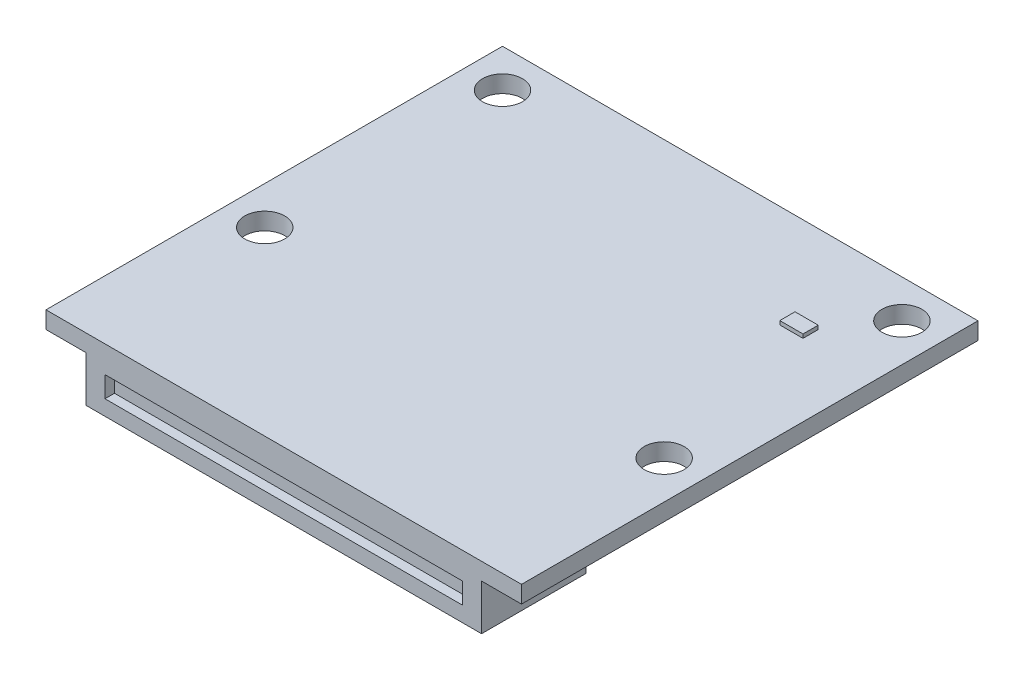
ISO-10303-21;
HEADER;
FILE_DESCRIPTION(('STEP AP214'),'2;1');
FILE_NAME('part.step','',(''),(''),'','','');
FILE_SCHEMA(('AUTOMOTIVE_DESIGN { 1 0 10303 214 1 1 1 1 }'));
ENDSEC;
DATA;
#1=APPLICATION_CONTEXT('core data for automotive mechanical design processes');
#2=APPLICATION_PROTOCOL_DEFINITION('international standard','automotive_design',2000,#1);
#3=PRODUCT_CONTEXT('',#1,'mechanical');
#4=PRODUCT('Part','Part','',(#3));
#5=PRODUCT_RELATED_PRODUCT_CATEGORY('part','',(#4));
#6=PRODUCT_DEFINITION_FORMATION('','',#4);
#7=PRODUCT_DEFINITION_CONTEXT('part definition',#1,'design');
#8=PRODUCT_DEFINITION('design','',#6,#7);
#9=PRODUCT_DEFINITION_SHAPE('','',#8);
#10=(LENGTH_UNIT() NAMED_UNIT(*) SI_UNIT(.MILLI.,.METRE.));
#11=(NAMED_UNIT(*) PLANE_ANGLE_UNIT() SI_UNIT($,.RADIAN.));
#12=(NAMED_UNIT(*) SI_UNIT($,.STERADIAN.) SOLID_ANGLE_UNIT());
#13=UNCERTAINTY_MEASURE_WITH_UNIT(LENGTH_MEASURE(1.E-05),#10,'distance_accuracy_value','');
#14=(GEOMETRIC_REPRESENTATION_CONTEXT(3) GLOBAL_UNCERTAINTY_ASSIGNED_CONTEXT((#13)) GLOBAL_UNIT_ASSIGNED_CONTEXT((#10,
#11,#12)) REPRESENTATION_CONTEXT('',''));
#15=CARTESIAN_POINT('',(0.,0.,0.));
#16=DIRECTION('',(0.,0.,1.));
#17=DIRECTION('',(1.,0.,0.));
#18=AXIS2_PLACEMENT_3D('',#15,#16,#17);
#19=CARTESIAN_POINT('',(0.,0.,0.));
#20=DIRECTION('',(0.,1.,0.));
#21=DIRECTION('',(0.,0.,1.));
#22=AXIS2_PLACEMENT_3D('',#19,#20,#21);
#23=PLANE('',#22);
#24=DIRECTION('',(0.,0.,1.));
#25=VECTOR('',#24,1.);
#26=CARTESIAN_POINT('',(-12.5,0.,-14.5));
#27=LINE('',#26,#25);
#28=CARTESIAN_POINT('',(-12.5,0.,-14.5));
#29=VERTEX_POINT('',#28);
#30=CARTESIAN_POINT('',(-12.5,0.,9.5));
#31=VERTEX_POINT('',#30);
#32=EDGE_CURVE('E277',#29,#31,#27,.T.);
#33=ORIENTED_EDGE('',*,*,#32,.T.);
#34=DIRECTION('',(1.,0.,0.));
#35=VECTOR('',#34,1.);
#36=CARTESIAN_POINT('',(-12.5,0.,9.5));
#37=LINE('',#36,#35);
#38=CARTESIAN_POINT('',(12.5,0.,9.5));
#39=VERTEX_POINT('',#38);
#40=EDGE_CURVE('E280',#31,#39,#37,.T.);
#41=ORIENTED_EDGE('',*,*,#40,.T.);
#42=DIRECTION('',(0.,0.,-1.));
#43=VECTOR('',#42,1.);
#44=CARTESIAN_POINT('',(12.5,0.,-14.5));
#45=LINE('',#44,#43);
#46=CARTESIAN_POINT('',(12.5,0.,-14.5));
#47=VERTEX_POINT('',#46);
#48=EDGE_CURVE('E284',#39,#47,#45,.T.);
#49=ORIENTED_EDGE('',*,*,#48,.T.);
#50=DIRECTION('',(-1.,0.,0.));
#51=VECTOR('',#50,1.);
#52=CARTESIAN_POINT('',(-12.5,0.,-14.5));
#53=LINE('',#52,#51);
#54=EDGE_CURVE('E287',#47,#29,#53,.T.);
#55=ORIENTED_EDGE('',*,*,#54,.T.);
#56=EDGE_LOOP('',(#33,#41,#49,#55));
#57=FACE_BOUND('',#56,.T.);
#58=CARTESIAN_POINT('',(10.5,0.,-12.5));
#59=DIRECTION('',(0.,1.,0.));
#60=DIRECTION('',(0.,0.,1.));
#61=AXIS2_PLACEMENT_3D('',#58,#59,#60);
#62=CIRCLE('',#61,1.05);
#63=CARTESIAN_POINT('',(10.5,0.,-11.45));
#64=VERTEX_POINT('',#63);
#65=EDGE_CURVE('E339',#64,#64,#62,.T.);
#66=ORIENTED_EDGE('',*,*,#65,.F.);
#67=EDGE_LOOP('',(#66));
#68=FACE_BOUND('',#67,.T.);
#69=CARTESIAN_POINT('',(10.5,0.,0.));
#70=DIRECTION('',(0.,1.,0.));
#71=DIRECTION('',(0.,0.,1.));
#72=AXIS2_PLACEMENT_3D('',#69,#70,#71);
#73=CIRCLE('',#72,1.05);
#74=CARTESIAN_POINT('',(10.5,0.,1.05));
#75=VERTEX_POINT('',#74);
#76=EDGE_CURVE('E333',#75,#75,#73,.T.);
#77=ORIENTED_EDGE('',*,*,#76,.F.);
#78=EDGE_LOOP('',(#77));
#79=FACE_BOUND('',#78,.T.);
#80=CARTESIAN_POINT('',(-10.5,0.,0.));
#81=DIRECTION('',(0.,1.,0.));
#82=DIRECTION('',(0.,0.,-1.));
#83=AXIS2_PLACEMENT_3D('',#80,#81,#82);
#84=CIRCLE('',#83,1.05);
#85=CARTESIAN_POINT('',(-10.5,0.,-1.05));
#86=VERTEX_POINT('',#85);
#87=EDGE_CURVE('E328',#86,#86,#84,.T.);
#88=ORIENTED_EDGE('',*,*,#87,.F.);
#89=EDGE_LOOP('',(#88));
#90=FACE_BOUND('',#89,.T.);
#91=CARTESIAN_POINT('',(-10.5,0.,-12.5));
#92=DIRECTION('',(0.,1.,0.));
#93=DIRECTION('',(0.,0.,-1.));
#94=AXIS2_PLACEMENT_3D('',#91,#92,#93);
#95=CIRCLE('',#94,1.05);
#96=CARTESIAN_POINT('',(-10.5,0.,-13.55));
#97=VERTEX_POINT('',#96);
#98=EDGE_CURVE('E322',#97,#97,#95,.T.);
#99=ORIENTED_EDGE('',*,*,#98,.F.);
#100=EDGE_LOOP('',(#99));
#101=FACE_BOUND('',#100,.T.);
#102=DIRECTION('',(-1.,0.,0.));
#103=VECTOR('',#102,1.);
#104=CARTESIAN_POINT('',(8.7,0.,-9.9));
#105=LINE('',#104,#103);
#106=CARTESIAN_POINT('',(8.7,0.,-9.9));
#107=VERTEX_POINT('',#106);
#108=CARTESIAN_POINT('',(7.48,0.,-9.9));
#109=VERTEX_POINT('',#108);
#110=EDGE_CURVE('E206',#107,#109,#105,.T.);
#111=ORIENTED_EDGE('',*,*,#110,.F.);
#112=DIRECTION('',(0.,0.,-1.));
#113=VECTOR('',#112,1.);
#114=CARTESIAN_POINT('',(8.7,0.,-9.1));
#115=LINE('',#114,#113);
#116=CARTESIAN_POINT('',(8.7,0.,-9.1));
#117=VERTEX_POINT('',#116);
#118=EDGE_CURVE('E189',#117,#107,#115,.T.);
#119=ORIENTED_EDGE('',*,*,#118,.F.);
#120=DIRECTION('',(1.,0.,0.));
#121=VECTOR('',#120,1.);
#122=CARTESIAN_POINT('',(8.7,0.,-9.1));
#123=LINE('',#122,#121);
#124=CARTESIAN_POINT('',(7.48,0.,-9.1));
#125=VERTEX_POINT('',#124);
#126=EDGE_CURVE('E197',#125,#117,#123,.T.);
#127=ORIENTED_EDGE('',*,*,#126,.F.);
#128=DIRECTION('',(0.,0.,1.));
#129=VECTOR('',#128,1.);
#130=CARTESIAN_POINT('',(7.48,0.,-9.1));
#131=LINE('',#130,#129);
#132=EDGE_CURVE('E208',#109,#125,#131,.T.);
#133=ORIENTED_EDGE('',*,*,#132,.F.);
#134=EDGE_LOOP('',(#111,#119,#127,#133));
#135=FACE_BOUND('',#134,.T.);
#136=ADVANCED_FACE('F39',(#57,#68,#79,#90,#101,#135),#23,.T.);
#137=CARTESIAN_POINT('',(0.,-0.9,0.));
#138=DIRECTION('',(0.,1.,0.));
#139=DIRECTION('',(0.,0.,1.));
#140=AXIS2_PLACEMENT_3D('',#137,#138,#139);
#141=PLANE('',#140);
#142=CARTESIAN_POINT('',(10.5,-0.9,-12.5));
#143=DIRECTION('',(0.,1.,0.));
#144=DIRECTION('',(0.,0.,1.));
#145=AXIS2_PLACEMENT_3D('',#142,#143,#144);
#146=CIRCLE('',#145,1.05);
#147=CARTESIAN_POINT('',(10.5,-0.9,-11.45));
#148=VERTEX_POINT('',#147);
#149=EDGE_CURVE('E281',#148,#148,#146,.T.);
#150=ORIENTED_EDGE('',*,*,#149,.T.);
#151=EDGE_LOOP('',(#150));
#152=FACE_BOUND('',#151,.T.);
#153=CARTESIAN_POINT('',(10.5,-0.9,0.));
#154=DIRECTION('',(0.,1.,0.));
#155=DIRECTION('',(0.,0.,1.));
#156=AXIS2_PLACEMENT_3D('',#153,#154,#155);
#157=CIRCLE('',#156,1.05);
#158=CARTESIAN_POINT('',(10.5,-0.9,1.05));
#159=VERTEX_POINT('',#158);
#160=EDGE_CURVE('E336',#159,#159,#157,.T.);
#161=ORIENTED_EDGE('',*,*,#160,.T.);
#162=EDGE_LOOP('',(#161));
#163=FACE_BOUND('',#162,.T.);
#164=CARTESIAN_POINT('',(-10.5,-0.9,0.));
#165=DIRECTION('',(0.,1.,0.));
#166=DIRECTION('',(0.,0.,-1.));
#167=AXIS2_PLACEMENT_3D('',#164,#165,#166);
#168=CIRCLE('',#167,1.05);
#169=CARTESIAN_POINT('',(-10.5,-0.9,-1.05));
#170=VERTEX_POINT('',#169);
#171=EDGE_CURVE('E330',#170,#170,#168,.T.);
#172=ORIENTED_EDGE('',*,*,#171,.T.);
#173=EDGE_LOOP('',(#172));
#174=FACE_BOUND('',#173,.T.);
#175=CARTESIAN_POINT('',(-10.5,-0.9,-12.5));
#176=DIRECTION('',(0.,1.,0.));
#177=DIRECTION('',(0.,0.,-1.));
#178=AXIS2_PLACEMENT_3D('',#175,#176,#177);
#179=CIRCLE('',#178,1.05);
#180=CARTESIAN_POINT('',(-10.5,-0.9,-13.55));
#181=VERTEX_POINT('',#180);
#182=EDGE_CURVE('E324',#181,#181,#179,.T.);
#183=ORIENTED_EDGE('',*,*,#182,.T.);
#184=EDGE_LOOP('',(#183));
#185=FACE_BOUND('',#184,.T.);
#186=DIRECTION('',(0.,0.,-1.));
#187=VECTOR('',#186,1.);
#188=CARTESIAN_POINT('',(-10.4,-0.9,9.5));
#189=LINE('',#188,#187);
#190=CARTESIAN_POINT('',(-10.4,-0.9,9.5));
#191=VERTEX_POINT('',#190);
#192=CARTESIAN_POINT('',(-10.4,-0.9,4.));
#193=VERTEX_POINT('',#192);
#194=EDGE_CURVE('E219',#191,#193,#189,.T.);
#195=ORIENTED_EDGE('',*,*,#194,.F.);
#196=DIRECTION('',(1.,0.,0.));
#197=VECTOR('',#196,1.);
#198=CARTESIAN_POINT('',(-12.5,-0.9,9.5));
#199=LINE('',#198,#197);
#200=CARTESIAN_POINT('',(-12.5,-0.9,9.5));
#201=VERTEX_POINT('',#200);
#202=EDGE_CURVE('E262',#201,#191,#199,.T.);
#203=ORIENTED_EDGE('',*,*,#202,.F.);
#204=DIRECTION('',(0.,0.,1.));
#205=VECTOR('',#204,1.);
#206=CARTESIAN_POINT('',(-12.5,-0.9,-14.5));
#207=LINE('',#206,#205);
#208=CARTESIAN_POINT('',(-12.5,-0.9,-14.5));
#209=VERTEX_POINT('',#208);
#210=EDGE_CURVE('E263',#209,#201,#207,.T.);
#211=ORIENTED_EDGE('',*,*,#210,.F.);
#212=DIRECTION('',(-1.,0.,0.));
#213=VECTOR('',#212,1.);
#214=CARTESIAN_POINT('',(-12.5,-0.9,-14.5));
#215=LINE('',#214,#213);
#216=CARTESIAN_POINT('',(12.5,-0.9,-14.5));
#217=VERTEX_POINT('',#216);
#218=EDGE_CURVE('E273',#217,#209,#215,.T.);
#219=ORIENTED_EDGE('',*,*,#218,.F.);
#220=DIRECTION('',(0.,0.,-1.));
#221=VECTOR('',#220,1.);
#222=CARTESIAN_POINT('',(12.5,-0.9,-14.5));
#223=LINE('',#222,#221);
#224=CARTESIAN_POINT('',(12.5,-0.9,9.5));
#225=VERTEX_POINT('',#224);
#226=EDGE_CURVE('E269',#225,#217,#223,.T.);
#227=ORIENTED_EDGE('',*,*,#226,.F.);
#228=CARTESIAN_POINT('',(10.4,-0.9,9.5));
#229=VERTEX_POINT('',#228);
#230=EDGE_CURVE('E259',#229,#225,#199,.T.);
#231=ORIENTED_EDGE('',*,*,#230,.F.);
#232=DIRECTION('',(0.,0.,1.));
#233=VECTOR('',#232,1.);
#234=CARTESIAN_POINT('',(10.4,-0.9,9.5));
#235=LINE('',#234,#233);
#236=CARTESIAN_POINT('',(10.4,-0.9,4.));
#237=VERTEX_POINT('',#236);
#238=EDGE_CURVE('E224',#237,#229,#235,.T.);
#239=ORIENTED_EDGE('',*,*,#238,.F.);
#240=DIRECTION('',(1.,0.,0.));
#241=VECTOR('',#240,1.);
#242=CARTESIAN_POINT('',(-10.4,-0.9,4.));
#243=LINE('',#242,#241);
#244=EDGE_CURVE('E231',#193,#237,#243,.T.);
#245=ORIENTED_EDGE('',*,*,#244,.F.);
#246=EDGE_LOOP('',(#195,#203,#211,#219,#227,#231,#239,#245));
#247=FACE_BOUND('',#246,.T.);
#248=ADVANCED_FACE('F309',(#152,#163,#174,#185,#247),#141,.F.);
#249=CARTESIAN_POINT('',(-12.5,-0.9,-14.5));
#250=DIRECTION('',(-1.,0.,0.));
#251=DIRECTION('',(0.,0.,1.));
#252=AXIS2_PLACEMENT_3D('',#249,#250,#251);
#253=PLANE('',#252);
#254=ORIENTED_EDGE('',*,*,#32,.F.);
#255=DIRECTION('',(0.,1.,0.));
#256=VECTOR('',#255,1.);
#257=CARTESIAN_POINT('',(-12.5,-0.9,-14.5));
#258=LINE('',#257,#256);
#259=EDGE_CURVE('E11',#209,#29,#258,.T.);
#260=ORIENTED_EDGE('',*,*,#259,.F.);
#261=ORIENTED_EDGE('',*,*,#210,.T.);
#262=DIRECTION('',(0.,1.,0.));
#263=VECTOR('',#262,1.);
#264=CARTESIAN_POINT('',(-12.5,-0.9,9.5));
#265=LINE('',#264,#263);
#266=EDGE_CURVE('E276',#201,#31,#265,.T.);
#267=ORIENTED_EDGE('',*,*,#266,.T.);
#268=EDGE_LOOP('',(#254,#260,#261,#267));
#269=FACE_BOUND('',#268,.T.);
#270=ADVANCED_FACE('F41',(#269),#253,.T.);
#271=CARTESIAN_POINT('',(-12.5,-0.9,-14.5));
#272=DIRECTION('',(0.,0.,-1.));
#273=DIRECTION('',(-1.,0.,0.));
#274=AXIS2_PLACEMENT_3D('',#271,#272,#273);
#275=PLANE('',#274);
#276=ORIENTED_EDGE('',*,*,#54,.F.);
#277=DIRECTION('',(0.,1.,0.));
#278=VECTOR('',#277,1.);
#279=CARTESIAN_POINT('',(12.5,-0.9,-14.5));
#280=LINE('',#279,#278);
#281=EDGE_CURVE('E48',#217,#47,#280,.T.);
#282=ORIENTED_EDGE('',*,*,#281,.F.);
#283=ORIENTED_EDGE('',*,*,#218,.T.);
#284=ORIENTED_EDGE('',*,*,#259,.T.);
#285=EDGE_LOOP('',(#276,#282,#283,#284));
#286=FACE_BOUND('',#285,.T.);
#287=ADVANCED_FACE('F306',(#286),#275,.T.);
#288=CARTESIAN_POINT('',(12.5,-0.9,-14.5));
#289=DIRECTION('',(1.,0.,0.));
#290=DIRECTION('',(0.,0.,-1.));
#291=AXIS2_PLACEMENT_3D('',#288,#289,#290);
#292=PLANE('',#291);
#293=ORIENTED_EDGE('',*,*,#48,.F.);
#294=DIRECTION('',(0.,1.,0.));
#295=VECTOR('',#294,1.);
#296=CARTESIAN_POINT('',(12.5,-0.9,9.5));
#297=LINE('',#296,#295);
#298=EDGE_CURVE('E291',#225,#39,#297,.T.);
#299=ORIENTED_EDGE('',*,*,#298,.F.);
#300=ORIENTED_EDGE('',*,*,#226,.T.);
#301=ORIENTED_EDGE('',*,*,#281,.T.);
#302=EDGE_LOOP('',(#293,#299,#300,#301));
#303=FACE_BOUND('',#302,.T.);
#304=ADVANCED_FACE('F416',(#303),#292,.T.);
#305=CARTESIAN_POINT('',(-12.5,-0.9,9.5));
#306=DIRECTION('',(0.,0.,1.));
#307=DIRECTION('',(1.,0.,0.));
#308=AXIS2_PLACEMENT_3D('',#305,#306,#307);
#309=PLANE('',#308);
#310=DIRECTION('',(0.,-1.,0.));
#311=VECTOR('',#310,1.);
#312=CARTESIAN_POINT('',(-9.4,-1.4,9.5));
#313=LINE('',#312,#311);
#314=CARTESIAN_POINT('',(-9.4,-1.4,9.5));
#315=VERTEX_POINT('',#314);
#316=CARTESIAN_POINT('',(-9.4,-2.5,9.5));
#317=VERTEX_POINT('',#316);
#318=EDGE_CURVE('E56',#315,#317,#313,.T.);
#319=ORIENTED_EDGE('',*,*,#318,.F.);
#320=DIRECTION('',(-1.,0.,0.));
#321=VECTOR('',#320,1.);
#322=CARTESIAN_POINT('',(-9.4,-1.4,9.5));
#323=LINE('',#322,#321);
#324=CARTESIAN_POINT('',(9.4,-1.4,9.5));
#325=VERTEX_POINT('',#324);
#326=EDGE_CURVE('E174',#325,#315,#323,.T.);
#327=ORIENTED_EDGE('',*,*,#326,.F.);
#328=DIRECTION('',(0.,1.,0.));
#329=VECTOR('',#328,1.);
#330=CARTESIAN_POINT('',(9.4,-1.4,9.5));
#331=LINE('',#330,#329);
#332=CARTESIAN_POINT('',(9.4,-2.5,9.5));
#333=VERTEX_POINT('',#332);
#334=EDGE_CURVE('E177',#333,#325,#331,.T.);
#335=ORIENTED_EDGE('',*,*,#334,.F.);
#336=DIRECTION('',(1.,0.,0.));
#337=VECTOR('',#336,1.);
#338=CARTESIAN_POINT('',(-9.4,-2.5,9.5));
#339=LINE('',#338,#337);
#340=EDGE_CURVE('E183',#317,#333,#339,.T.);
#341=ORIENTED_EDGE('',*,*,#340,.F.);
#342=EDGE_LOOP('',(#319,#327,#335,#341));
#343=FACE_BOUND('',#342,.T.);
#344=ORIENTED_EDGE('',*,*,#40,.F.);
#345=ORIENTED_EDGE('',*,*,#266,.F.);
#346=ORIENTED_EDGE('',*,*,#202,.T.);
#347=DIRECTION('',(0.,1.,0.));
#348=VECTOR('',#347,1.);
#349=CARTESIAN_POINT('',(-10.4,-3.3,9.5));
#350=LINE('',#349,#348);
#351=CARTESIAN_POINT('',(-10.4,-3.3,9.5));
#352=VERTEX_POINT('',#351);
#353=EDGE_CURVE('E230',#352,#191,#350,.T.);
#354=ORIENTED_EDGE('',*,*,#353,.F.);
#355=DIRECTION('',(-1.,0.,0.));
#356=VECTOR('',#355,1.);
#357=CARTESIAN_POINT('',(-10.4,-3.3,9.5));
#358=LINE('',#357,#356);
#359=CARTESIAN_POINT('',(10.4,-3.3,9.5));
#360=VERTEX_POINT('',#359);
#361=EDGE_CURVE('E228',#360,#352,#358,.T.);
#362=ORIENTED_EDGE('',*,*,#361,.F.);
#363=DIRECTION('',(0.,1.,0.));
#364=VECTOR('',#363,1.);
#365=CARTESIAN_POINT('',(10.4,-3.3,9.5));
#366=LINE('',#365,#364);
#367=EDGE_CURVE('E243',#360,#229,#366,.T.);
#368=ORIENTED_EDGE('',*,*,#367,.T.);
#369=ORIENTED_EDGE('',*,*,#230,.T.);
#370=ORIENTED_EDGE('',*,*,#298,.T.);
#371=EDGE_LOOP('',(#344,#345,#346,#354,#362,#368,#369,#370));
#372=FACE_BOUND('',#371,.T.);
#373=ADVANCED_FACE('F299',(#343,#372),#309,.T.);
#374=CARTESIAN_POINT('',(10.5,-0.9,-12.5));
#375=DIRECTION('',(0.,1.,0.));
#376=DIRECTION('',(0.,0.,1.));
#377=AXIS2_PLACEMENT_3D('',#374,#375,#376);
#378=CYLINDRICAL_SURFACE('',#377,1.05);
#379=ORIENTED_EDGE('',*,*,#149,.F.);
#380=EDGE_LOOP('',(#379));
#381=FACE_BOUND('',#380,.T.);
#382=ORIENTED_EDGE('',*,*,#65,.T.);
#383=EDGE_LOOP('',(#382));
#384=FACE_BOUND('',#383,.T.);
#385=ADVANCED_FACE('F346',(#381,#384),#378,.F.);
#386=CARTESIAN_POINT('',(10.5,-0.9,0.));
#387=DIRECTION('',(0.,1.,0.));
#388=DIRECTION('',(0.,0.,1.));
#389=AXIS2_PLACEMENT_3D('',#386,#387,#388);
#390=CYLINDRICAL_SURFACE('',#389,1.05);
#391=ORIENTED_EDGE('',*,*,#160,.F.);
#392=EDGE_LOOP('',(#391));
#393=FACE_BOUND('',#392,.T.);
#394=ORIENTED_EDGE('',*,*,#76,.T.);
#395=EDGE_LOOP('',(#394));
#396=FACE_BOUND('',#395,.T.);
#397=ADVANCED_FACE('F403',(#393,#396),#390,.F.);
#398=CARTESIAN_POINT('',(-10.5,-0.9,0.));
#399=DIRECTION('',(0.,1.,0.));
#400=DIRECTION('',(0.,0.,1.));
#401=AXIS2_PLACEMENT_3D('',#398,#399,#400);
#402=CYLINDRICAL_SURFACE('',#401,1.05);
#403=ORIENTED_EDGE('',*,*,#171,.F.);
#404=EDGE_LOOP('',(#403));
#405=FACE_BOUND('',#404,.T.);
#406=ORIENTED_EDGE('',*,*,#87,.T.);
#407=EDGE_LOOP('',(#406));
#408=FACE_BOUND('',#407,.T.);
#409=ADVANCED_FACE('F399',(#405,#408),#402,.F.);
#410=CARTESIAN_POINT('',(-10.5,-0.9,-12.5));
#411=DIRECTION('',(0.,1.,0.));
#412=DIRECTION('',(0.,0.,1.));
#413=AXIS2_PLACEMENT_3D('',#410,#411,#412);
#414=CYLINDRICAL_SURFACE('',#413,1.05);
#415=ORIENTED_EDGE('',*,*,#182,.F.);
#416=EDGE_LOOP('',(#415));
#417=FACE_BOUND('',#416,.T.);
#418=ORIENTED_EDGE('',*,*,#98,.T.);
#419=EDGE_LOOP('',(#418));
#420=FACE_BOUND('',#419,.T.);
#421=ADVANCED_FACE('F396',(#417,#420),#414,.F.);
#422=CARTESIAN_POINT('',(-10.4,-3.3,9.5));
#423=DIRECTION('',(1.,0.,0.));
#424=DIRECTION('',(0.,0.,-1.));
#425=AXIS2_PLACEMENT_3D('',#422,#423,#424);
#426=PLANE('',#425);
#427=ORIENTED_EDGE('',*,*,#194,.T.);
#428=DIRECTION('',(0.,1.,0.));
#429=VECTOR('',#428,1.);
#430=CARTESIAN_POINT('',(-10.4,-3.3,4.));
#431=LINE('',#430,#429);
#432=CARTESIAN_POINT('',(-10.4,-3.3,4.));
#433=VERTEX_POINT('',#432);
#434=EDGE_CURVE('E249',#433,#193,#431,.T.);
#435=ORIENTED_EDGE('',*,*,#434,.F.);
#436=DIRECTION('',(0.,0.,-1.));
#437=VECTOR('',#436,1.);
#438=CARTESIAN_POINT('',(-10.4,-3.3,9.5));
#439=LINE('',#438,#437);
#440=EDGE_CURVE('E220',#352,#433,#439,.T.);
#441=ORIENTED_EDGE('',*,*,#440,.F.);
#442=ORIENTED_EDGE('',*,*,#353,.T.);
#443=EDGE_LOOP('',(#427,#435,#441,#442));
#444=FACE_BOUND('',#443,.T.);
#445=ADVANCED_FACE('F312',(#444),#426,.F.);
#446=CARTESIAN_POINT('',(-10.4,-3.3,4.));
#447=DIRECTION('',(0.,0.,1.));
#448=DIRECTION('',(1.,0.,0.));
#449=AXIS2_PLACEMENT_3D('',#446,#447,#448);
#450=PLANE('',#449);
#451=ORIENTED_EDGE('',*,*,#244,.T.);
#452=DIRECTION('',(0.,1.,0.));
#453=VECTOR('',#452,1.);
#454=CARTESIAN_POINT('',(10.4,-3.3,4.));
#455=LINE('',#454,#453);
#456=CARTESIAN_POINT('',(10.4,-3.3,4.));
#457=VERTEX_POINT('',#456);
#458=EDGE_CURVE('E236',#457,#237,#455,.T.);
#459=ORIENTED_EDGE('',*,*,#458,.F.);
#460=DIRECTION('',(1.,0.,0.));
#461=VECTOR('',#460,1.);
#462=CARTESIAN_POINT('',(-10.4,-3.3,4.));
#463=LINE('',#462,#461);
#464=EDGE_CURVE('E223',#433,#457,#463,.T.);
#465=ORIENTED_EDGE('',*,*,#464,.F.);
#466=ORIENTED_EDGE('',*,*,#434,.T.);
#467=EDGE_LOOP('',(#451,#459,#465,#466));
#468=FACE_BOUND('',#467,.T.);
#469=ADVANCED_FACE('F321',(#468),#450,.F.);
#470=CARTESIAN_POINT('',(10.4,-3.3,9.5));
#471=DIRECTION('',(-1.,0.,0.));
#472=DIRECTION('',(0.,0.,1.));
#473=AXIS2_PLACEMENT_3D('',#470,#471,#472);
#474=PLANE('',#473);
#475=ORIENTED_EDGE('',*,*,#238,.T.);
#476=ORIENTED_EDGE('',*,*,#367,.F.);
#477=DIRECTION('',(0.,0.,1.));
#478=VECTOR('',#477,1.);
#479=CARTESIAN_POINT('',(10.4,-3.3,9.5));
#480=LINE('',#479,#478);
#481=EDGE_CURVE('E226',#457,#360,#480,.T.);
#482=ORIENTED_EDGE('',*,*,#481,.F.);
#483=ORIENTED_EDGE('',*,*,#458,.T.);
#484=EDGE_LOOP('',(#475,#476,#482,#483));
#485=FACE_BOUND('',#484,.T.);
#486=ADVANCED_FACE('F319',(#485),#474,.F.);
#487=CARTESIAN_POINT('',(0.,-3.3,0.));
#488=DIRECTION('',(0.,-1.,0.));
#489=DIRECTION('',(0.,0.,-1.));
#490=AXIS2_PLACEMENT_3D('',#487,#488,#489);
#491=PLANE('',#490);
#492=ORIENTED_EDGE('',*,*,#440,.T.);
#493=ORIENTED_EDGE('',*,*,#464,.T.);
#494=ORIENTED_EDGE('',*,*,#481,.T.);
#495=ORIENTED_EDGE('',*,*,#361,.T.);
#496=EDGE_LOOP('',(#492,#493,#494,#495));
#497=FACE_BOUND('',#496,.T.);
#498=ADVANCED_FACE('F315',(#497),#491,.T.);
#499=CARTESIAN_POINT('',(8.7,0.2,-9.1));
#500=DIRECTION('',(-1.,0.,0.));
#501=DIRECTION('',(0.,0.,1.));
#502=AXIS2_PLACEMENT_3D('',#499,#500,#501);
#503=PLANE('',#502);
#504=ORIENTED_EDGE('',*,*,#118,.T.);
#505=DIRECTION('',(0.,-1.,0.));
#506=VECTOR('',#505,1.);
#507=CARTESIAN_POINT('',(8.7,0.2,-9.9));
#508=LINE('',#507,#506);
#509=CARTESIAN_POINT('',(8.7,0.2,-9.9));
#510=VERTEX_POINT('',#509);
#511=EDGE_CURVE('E217',#510,#107,#508,.T.);
#512=ORIENTED_EDGE('',*,*,#511,.F.);
#513=DIRECTION('',(0.,0.,-1.));
#514=VECTOR('',#513,1.);
#515=CARTESIAN_POINT('',(8.7,0.2,-9.1));
#516=LINE('',#515,#514);
#517=CARTESIAN_POINT('',(8.7,0.2,-9.1));
#518=VERTEX_POINT('',#517);
#519=EDGE_CURVE('E193',#518,#510,#516,.T.);
#520=ORIENTED_EDGE('',*,*,#519,.F.);
#521=DIRECTION('',(0.,-1.,0.));
#522=VECTOR('',#521,1.);
#523=CARTESIAN_POINT('',(8.7,0.2,-9.1));
#524=LINE('',#523,#522);
#525=EDGE_CURVE('E203',#518,#117,#524,.T.);
#526=ORIENTED_EDGE('',*,*,#525,.T.);
#527=EDGE_LOOP('',(#504,#512,#520,#526));
#528=FACE_BOUND('',#527,.T.);
#529=ADVANCED_FACE('F372',(#528),#503,.F.);
#530=CARTESIAN_POINT('',(8.7,0.2,-9.9));
#531=DIRECTION('',(0.,0.,1.));
#532=DIRECTION('',(1.,0.,0.));
#533=AXIS2_PLACEMENT_3D('',#530,#531,#532);
#534=PLANE('',#533);
#535=ORIENTED_EDGE('',*,*,#110,.T.);
#536=DIRECTION('',(0.,-1.,0.));
#537=VECTOR('',#536,1.);
#538=CARTESIAN_POINT('',(7.48,0.2,-9.9));
#539=LINE('',#538,#537);
#540=CARTESIAN_POINT('',(7.48,0.2,-9.9));
#541=VERTEX_POINT('',#540);
#542=EDGE_CURVE('E214',#541,#109,#539,.T.);
#543=ORIENTED_EDGE('',*,*,#542,.F.);
#544=DIRECTION('',(-1.,0.,0.));
#545=VECTOR('',#544,1.);
#546=CARTESIAN_POINT('',(8.7,0.2,-9.9));
#547=LINE('',#546,#545);
#548=EDGE_CURVE('E196',#510,#541,#547,.T.);
#549=ORIENTED_EDGE('',*,*,#548,.F.);
#550=ORIENTED_EDGE('',*,*,#511,.T.);
#551=EDGE_LOOP('',(#535,#543,#549,#550));
#552=FACE_BOUND('',#551,.T.);
#553=ADVANCED_FACE('F362',(#552),#534,.F.);
#554=CARTESIAN_POINT('',(7.48,0.2,-9.1));
#555=DIRECTION('',(1.,0.,0.));
#556=DIRECTION('',(0.,0.,-1.));
#557=AXIS2_PLACEMENT_3D('',#554,#555,#556);
#558=PLANE('',#557);
#559=ORIENTED_EDGE('',*,*,#132,.T.);
#560=DIRECTION('',(0.,-1.,0.));
#561=VECTOR('',#560,1.);
#562=CARTESIAN_POINT('',(7.48,0.2,-9.1));
#563=LINE('',#562,#561);
#564=CARTESIAN_POINT('',(7.48,0.2,-9.1));
#565=VERTEX_POINT('',#564);
#566=EDGE_CURVE('E64',#565,#125,#563,.T.);
#567=ORIENTED_EDGE('',*,*,#566,.F.);
#568=DIRECTION('',(0.,0.,1.));
#569=VECTOR('',#568,1.);
#570=CARTESIAN_POINT('',(7.48,0.2,-9.1));
#571=LINE('',#570,#569);
#572=EDGE_CURVE('E199',#541,#565,#571,.T.);
#573=ORIENTED_EDGE('',*,*,#572,.F.);
#574=ORIENTED_EDGE('',*,*,#542,.T.);
#575=EDGE_LOOP('',(#559,#567,#573,#574));
#576=FACE_BOUND('',#575,.T.);
#577=ADVANCED_FACE('F366',(#576),#558,.F.);
#578=CARTESIAN_POINT('',(8.7,0.2,-9.1));
#579=DIRECTION('',(0.,0.,-1.));
#580=DIRECTION('',(-1.,0.,0.));
#581=AXIS2_PLACEMENT_3D('',#578,#579,#580);
#582=PLANE('',#581);
#583=ORIENTED_EDGE('',*,*,#126,.T.);
#584=ORIENTED_EDGE('',*,*,#525,.F.);
#585=DIRECTION('',(1.,0.,0.));
#586=VECTOR('',#585,1.);
#587=CARTESIAN_POINT('',(8.7,0.2,-9.1));
#588=LINE('',#587,#586);
#589=EDGE_CURVE('E201',#565,#518,#588,.T.);
#590=ORIENTED_EDGE('',*,*,#589,.F.);
#591=ORIENTED_EDGE('',*,*,#566,.T.);
#592=EDGE_LOOP('',(#583,#584,#590,#591));
#593=FACE_BOUND('',#592,.T.);
#594=ADVANCED_FACE('F373',(#593),#582,.F.);
#595=CARTESIAN_POINT('',(0.,0.2,0.));
#596=DIRECTION('',(0.,1.,0.));
#597=DIRECTION('',(0.,0.,1.));
#598=AXIS2_PLACEMENT_3D('',#595,#596,#597);
#599=PLANE('',#598);
#600=ORIENTED_EDGE('',*,*,#519,.T.);
#601=ORIENTED_EDGE('',*,*,#548,.T.);
#602=ORIENTED_EDGE('',*,*,#572,.T.);
#603=ORIENTED_EDGE('',*,*,#589,.T.);
#604=EDGE_LOOP('',(#600,#601,#602,#603));
#605=FACE_BOUND('',#604,.T.);
#606=ADVANCED_FACE('F368',(#605),#599,.T.);
#607=CARTESIAN_POINT('',(-9.4,-1.4,9.));
#608=DIRECTION('',(-1.,0.,0.));
#609=DIRECTION('',(0.,0.,1.));
#610=AXIS2_PLACEMENT_3D('',#607,#608,#609);
#611=PLANE('',#610);
#612=ORIENTED_EDGE('',*,*,#318,.T.);
#613=DIRECTION('',(0.,0.,1.));
#614=VECTOR('',#613,1.);
#615=CARTESIAN_POINT('',(-9.4,-2.5,9.));
#616=LINE('',#615,#614);
#617=CARTESIAN_POINT('',(-9.4,-2.5,9.));
#618=VERTEX_POINT('',#617);
#619=EDGE_CURVE('E152',#618,#317,#616,.T.);
#620=ORIENTED_EDGE('',*,*,#619,.F.);
#621=DIRECTION('',(0.,-1.,0.));
#622=VECTOR('',#621,1.);
#623=CARTESIAN_POINT('',(-9.4,-1.4,9.));
#624=LINE('',#623,#622);
#625=CARTESIAN_POINT('',(-9.4,-1.4,9.));
#626=VERTEX_POINT('',#625);
#627=EDGE_CURVE('E156',#626,#618,#624,.T.);
#628=ORIENTED_EDGE('',*,*,#627,.F.);
#629=DIRECTION('',(0.,0.,1.));
#630=VECTOR('',#629,1.);
#631=CARTESIAN_POINT('',(-9.4,-1.4,9.));
#632=LINE('',#631,#630);
#633=EDGE_CURVE('E187',#626,#315,#632,.T.);
#634=ORIENTED_EDGE('',*,*,#633,.T.);
#635=EDGE_LOOP('',(#612,#620,#628,#634));
#636=FACE_BOUND('',#635,.T.);
#637=ADVANCED_FACE('F154',(#636),#611,.F.);
#638=CARTESIAN_POINT('',(-9.4,-1.4,9.));
#639=DIRECTION('',(0.,1.,0.));
#640=DIRECTION('',(0.,0.,1.));
#641=AXIS2_PLACEMENT_3D('',#638,#639,#640);
#642=PLANE('',#641);
#643=ORIENTED_EDGE('',*,*,#326,.T.);
#644=ORIENTED_EDGE('',*,*,#633,.F.);
#645=DIRECTION('',(-1.,0.,0.));
#646=VECTOR('',#645,1.);
#647=CARTESIAN_POINT('',(-9.4,-1.4,9.));
#648=LINE('',#647,#646);
#649=CARTESIAN_POINT('',(9.4,-1.4,9.));
#650=VERTEX_POINT('',#649);
#651=EDGE_CURVE('E162',#650,#626,#648,.T.);
#652=ORIENTED_EDGE('',*,*,#651,.F.);
#653=DIRECTION('',(0.,0.,1.));
#654=VECTOR('',#653,1.);
#655=CARTESIAN_POINT('',(9.4,-1.4,9.));
#656=LINE('',#655,#654);
#657=EDGE_CURVE('E190',#650,#325,#656,.T.);
#658=ORIENTED_EDGE('',*,*,#657,.T.);
#659=EDGE_LOOP('',(#643,#644,#652,#658));
#660=FACE_BOUND('',#659,.T.);
#661=ADVANCED_FACE('F428',(#660),#642,.F.);
#662=CARTESIAN_POINT('',(9.4,-1.4,9.));
#663=DIRECTION('',(1.,0.,0.));
#664=DIRECTION('',(0.,0.,-1.));
#665=AXIS2_PLACEMENT_3D('',#662,#663,#664);
#666=PLANE('',#665);
#667=ORIENTED_EDGE('',*,*,#334,.T.);
#668=ORIENTED_EDGE('',*,*,#657,.F.);
#669=DIRECTION('',(0.,1.,0.));
#670=VECTOR('',#669,1.);
#671=CARTESIAN_POINT('',(9.4,-1.4,9.));
#672=LINE('',#671,#670);
#673=CARTESIAN_POINT('',(9.4,-2.5,9.));
#674=VERTEX_POINT('',#673);
#675=EDGE_CURVE('E170',#674,#650,#672,.T.);
#676=ORIENTED_EDGE('',*,*,#675,.F.);
#677=DIRECTION('',(0.,0.,1.));
#678=VECTOR('',#677,1.);
#679=CARTESIAN_POINT('',(9.4,-2.5,9.));
#680=LINE('',#679,#678);
#681=EDGE_CURVE('E161',#674,#333,#680,.T.);
#682=ORIENTED_EDGE('',*,*,#681,.T.);
#683=EDGE_LOOP('',(#667,#668,#676,#682));
#684=FACE_BOUND('',#683,.T.);
#685=ADVANCED_FACE('F426',(#684),#666,.F.);
#686=CARTESIAN_POINT('',(-9.4,-2.5,9.));
#687=DIRECTION('',(0.,-1.,0.));
#688=DIRECTION('',(0.,0.,-1.));
#689=AXIS2_PLACEMENT_3D('',#686,#687,#688);
#690=PLANE('',#689);
#691=ORIENTED_EDGE('',*,*,#340,.T.);
#692=ORIENTED_EDGE('',*,*,#681,.F.);
#693=DIRECTION('',(1.,0.,0.));
#694=VECTOR('',#693,1.);
#695=CARTESIAN_POINT('',(-9.4,-2.5,9.));
#696=LINE('',#695,#694);
#697=EDGE_CURVE('E165',#618,#674,#696,.T.);
#698=ORIENTED_EDGE('',*,*,#697,.F.);
#699=ORIENTED_EDGE('',*,*,#619,.T.);
#700=EDGE_LOOP('',(#691,#692,#698,#699));
#701=FACE_BOUND('',#700,.T.);
#702=ADVANCED_FACE('F166',(#701),#690,.F.);
#703=CARTESIAN_POINT('',(0.,0.,9.));
#704=DIRECTION('',(0.,0.,1.));
#705=DIRECTION('',(1.,0.,0.));
#706=AXIS2_PLACEMENT_3D('',#703,#704,#705);
#707=PLANE('',#706);
#708=ORIENTED_EDGE('',*,*,#627,.T.);
#709=ORIENTED_EDGE('',*,*,#697,.T.);
#710=ORIENTED_EDGE('',*,*,#675,.T.);
#711=ORIENTED_EDGE('',*,*,#651,.T.);
#712=EDGE_LOOP('',(#708,#709,#710,#711));
#713=FACE_BOUND('',#712,.T.);
#714=ADVANCED_FACE('F172',(#713),#707,.T.);
#715=CLOSED_SHELL('',(#136,#248,#270,#287,#304,#373,#385,#397,#409,#421,#445,#469,#486,#498,
#529,#553,#577,#594,#606,#637,#661,#685,#702,#714));
#716=MANIFOLD_SOLID_BREP('B2',#715);
#717=ADVANCED_BREP_SHAPE_REPRESENTATION('',(#18,#716),#14);
#718=SHAPE_DEFINITION_REPRESENTATION(#9,#717);
ENDSEC;
END-ISO-10303-21;
